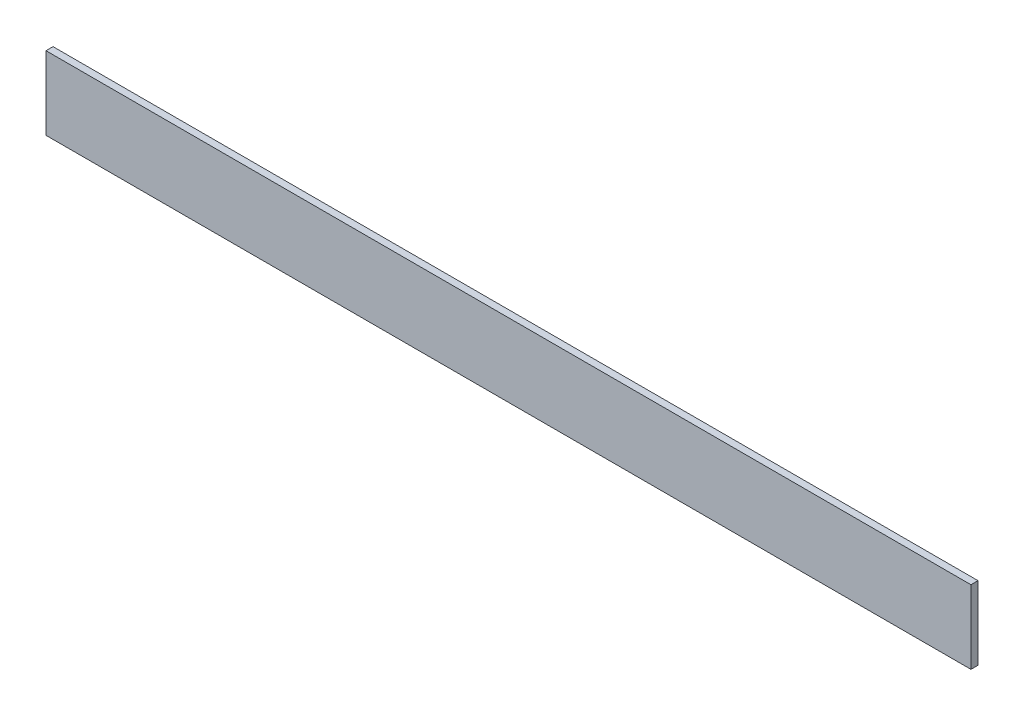
ISO-10303-21;
HEADER;
FILE_DESCRIPTION(('STEP AP214'),'2;1');
FILE_NAME('part.step','',(''),(''),'','','');
FILE_SCHEMA(('AUTOMOTIVE_DESIGN { 1 0 10303 214 1 1 1 1 }'));
ENDSEC;
DATA;
#1=APPLICATION_CONTEXT('core data for automotive mechanical design processes');
#2=APPLICATION_PROTOCOL_DEFINITION('international standard','automotive_design',2000,#1);
#3=PRODUCT_CONTEXT('',#1,'mechanical');
#4=PRODUCT('Part','Part','',(#3));
#5=PRODUCT_RELATED_PRODUCT_CATEGORY('part','',(#4));
#6=PRODUCT_DEFINITION_FORMATION('','',#4);
#7=PRODUCT_DEFINITION_CONTEXT('part definition',#1,'design');
#8=PRODUCT_DEFINITION('design','',#6,#7);
#9=PRODUCT_DEFINITION_SHAPE('','',#8);
#10=(LENGTH_UNIT() NAMED_UNIT(*) SI_UNIT(.MILLI.,.METRE.));
#11=(NAMED_UNIT(*) PLANE_ANGLE_UNIT() SI_UNIT($,.RADIAN.));
#12=(NAMED_UNIT(*) SI_UNIT($,.STERADIAN.) SOLID_ANGLE_UNIT());
#13=UNCERTAINTY_MEASURE_WITH_UNIT(LENGTH_MEASURE(1.E-05),#10,'distance_accuracy_value','');
#14=(GEOMETRIC_REPRESENTATION_CONTEXT(3) GLOBAL_UNCERTAINTY_ASSIGNED_CONTEXT((#13)) GLOBAL_UNIT_ASSIGNED_CONTEXT((#10,
#11,#12)) REPRESENTATION_CONTEXT('',''));
#15=CARTESIAN_POINT('',(0.,0.,0.));
#16=DIRECTION('',(0.,0.,1.));
#17=DIRECTION('',(1.,0.,0.));
#18=AXIS2_PLACEMENT_3D('',#15,#16,#17);
#19=CARTESIAN_POINT('',(-221.22705882353,38.7137557631378,3.175));
#20=DIRECTION('',(1.,0.,0.));
#21=DIRECTION('',(0.,0.,-1.));
#22=AXIS2_PLACEMENT_3D('',#19,#20,#21);
#23=PLANE('',#22);
#24=DIRECTION('',(0.,-1.,0.));
#25=VECTOR('',#24,1.);
#26=CARTESIAN_POINT('',(-221.22705882353,38.7137557631378,0.));
#27=LINE('',#26,#25);
#28=CARTESIAN_POINT('',(-221.22705882353,38.7137557631378,0.));
#29=VERTEX_POINT('',#28);
#30=CARTESIAN_POINT('',(-221.22705882353,5.73529411764702,0.));
#31=VERTEX_POINT('',#30);
#32=EDGE_CURVE('E102',#29,#31,#27,.T.);
#33=ORIENTED_EDGE('',*,*,#32,.T.);
#34=DIRECTION('',(0.,0.,-1.));
#35=VECTOR('',#34,1.);
#36=CARTESIAN_POINT('',(-221.22705882353,5.73529411764702,3.175));
#37=LINE('',#36,#35);
#38=CARTESIAN_POINT('',(-221.22705882353,5.73529411764702,3.175));
#39=VERTEX_POINT('',#38);
#40=EDGE_CURVE('E11',#39,#31,#37,.T.);
#41=ORIENTED_EDGE('',*,*,#40,.F.);
#42=DIRECTION('',(0.,-1.,0.));
#43=VECTOR('',#42,1.);
#44=CARTESIAN_POINT('',(-221.22705882353,38.7137557631378,3.175));
#45=LINE('',#44,#43);
#46=CARTESIAN_POINT('',(-221.22705882353,38.7137557631378,3.175));
#47=VERTEX_POINT('',#46);
#48=EDGE_CURVE('E90',#47,#39,#45,.T.);
#49=ORIENTED_EDGE('',*,*,#48,.F.);
#50=DIRECTION('',(0.,0.,-1.));
#51=VECTOR('',#50,1.);
#52=CARTESIAN_POINT('',(-221.22705882353,38.7137557631378,3.175));
#53=LINE('',#52,#51);
#54=EDGE_CURVE('E98',#47,#29,#53,.T.);
#55=ORIENTED_EDGE('',*,*,#54,.T.);
#56=EDGE_LOOP('',(#33,#41,#49,#55));
#57=FACE_BOUND('',#56,.T.);
#58=ADVANCED_FACE('F39',(#57),#23,.F.);
#59=CARTESIAN_POINT('',(-221.22705882353,5.73529411764702,3.175));
#60=DIRECTION('',(0.,1.,0.));
#61=DIRECTION('',(-1.,0.,0.));
#62=AXIS2_PLACEMENT_3D('',#59,#60,#61);
#63=PLANE('',#62);
#64=DIRECTION('',(1.,0.,0.));
#65=VECTOR('',#64,1.);
#66=CARTESIAN_POINT('',(-221.22705882353,5.73529411764702,0.));
#67=LINE('',#66,#65);
#68=CARTESIAN_POINT('',(194.85294117647,5.73529411764705,0.));
#69=VERTEX_POINT('',#68);
#70=EDGE_CURVE('E94',#31,#69,#67,.T.);
#71=ORIENTED_EDGE('',*,*,#70,.T.);
#72=DIRECTION('',(0.,0.,-1.));
#73=VECTOR('',#72,1.);
#74=CARTESIAN_POINT('',(194.85294117647,5.73529411764705,3.175));
#75=LINE('',#74,#73);
#76=CARTESIAN_POINT('',(194.85294117647,5.73529411764705,3.175));
#77=VERTEX_POINT('',#76);
#78=EDGE_CURVE('E47',#77,#69,#75,.T.);
#79=ORIENTED_EDGE('',*,*,#78,.F.);
#80=DIRECTION('',(1.,0.,0.));
#81=VECTOR('',#80,1.);
#82=CARTESIAN_POINT('',(-221.22705882353,5.73529411764702,3.175));
#83=LINE('',#82,#81);
#84=EDGE_CURVE('E85',#39,#77,#83,.T.);
#85=ORIENTED_EDGE('',*,*,#84,.F.);
#86=ORIENTED_EDGE('',*,*,#40,.T.);
#87=EDGE_LOOP('',(#71,#79,#85,#86));
#88=FACE_BOUND('',#87,.T.);
#89=ADVANCED_FACE('F93',(#88),#63,.F.);
#90=CARTESIAN_POINT('',(194.85294117647,38.7137557631378,3.175));
#91=DIRECTION('',(-1.,0.,0.));
#92=DIRECTION('',(0.,0.,1.));
#93=AXIS2_PLACEMENT_3D('',#90,#91,#92);
#94=PLANE('',#93);
#95=DIRECTION('',(0.,1.,0.));
#96=VECTOR('',#95,1.);
#97=CARTESIAN_POINT('',(194.85294117647,38.7137557631378,0.));
#98=LINE('',#97,#96);
#99=CARTESIAN_POINT('',(194.85294117647,38.7137557631378,0.));
#100=VERTEX_POINT('',#99);
#101=EDGE_CURVE('E72',#69,#100,#98,.T.);
#102=ORIENTED_EDGE('',*,*,#101,.T.);
#103=DIRECTION('',(0.,0.,-1.));
#104=VECTOR('',#103,1.);
#105=CARTESIAN_POINT('',(194.85294117647,38.7137557631378,3.175));
#106=LINE('',#105,#104);
#107=CARTESIAN_POINT('',(194.85294117647,38.7137557631378,3.175));
#108=VERTEX_POINT('',#107);
#109=EDGE_CURVE('E95',#108,#100,#106,.T.);
#110=ORIENTED_EDGE('',*,*,#109,.F.);
#111=DIRECTION('',(0.,1.,0.));
#112=VECTOR('',#111,1.);
#113=CARTESIAN_POINT('',(194.85294117647,38.7137557631378,3.175));
#114=LINE('',#113,#112);
#115=EDGE_CURVE('E88',#77,#108,#114,.T.);
#116=ORIENTED_EDGE('',*,*,#115,.F.);
#117=ORIENTED_EDGE('',*,*,#78,.T.);
#118=EDGE_LOOP('',(#102,#110,#116,#117));
#119=FACE_BOUND('',#118,.T.);
#120=ADVANCED_FACE('F96',(#119),#94,.F.);
#121=CARTESIAN_POINT('',(-221.22705882353,38.7137557631378,3.175));
#122=DIRECTION('',(0.,-1.,0.));
#123=DIRECTION('',(0.,0.,-1.));
#124=AXIS2_PLACEMENT_3D('',#121,#122,#123);
#125=PLANE('',#124);
#126=DIRECTION('',(-1.,0.,0.));
#127=VECTOR('',#126,1.);
#128=CARTESIAN_POINT('',(-221.22705882353,38.7137557631378,0.));
#129=LINE('',#128,#127);
#130=EDGE_CURVE('E78',#100,#29,#129,.T.);
#131=ORIENTED_EDGE('',*,*,#130,.T.);
#132=ORIENTED_EDGE('',*,*,#54,.F.);
#133=DIRECTION('',(-1.,0.,0.));
#134=VECTOR('',#133,1.);
#135=CARTESIAN_POINT('',(-221.22705882353,38.7137557631378,3.175));
#136=LINE('',#135,#134);
#137=EDGE_CURVE('E55',#108,#47,#136,.T.);
#138=ORIENTED_EDGE('',*,*,#137,.F.);
#139=ORIENTED_EDGE('',*,*,#109,.T.);
#140=EDGE_LOOP('',(#131,#132,#138,#139));
#141=FACE_BOUND('',#140,.T.);
#142=ADVANCED_FACE('F109',(#141),#125,.F.);
#143=CARTESIAN_POINT('',(0.,0.,3.175));
#144=DIRECTION('',(0.,0.,1.));
#145=DIRECTION('',(1.,0.,0.));
#146=AXIS2_PLACEMENT_3D('',#143,#144,#145);
#147=PLANE('',#146);
#148=ORIENTED_EDGE('',*,*,#48,.T.);
#149=ORIENTED_EDGE('',*,*,#84,.T.);
#150=ORIENTED_EDGE('',*,*,#115,.T.);
#151=ORIENTED_EDGE('',*,*,#137,.T.);
#152=EDGE_LOOP('',(#148,#149,#150,#151));
#153=FACE_BOUND('',#152,.T.);
#154=ADVANCED_FACE('F86',(#153),#147,.T.);
#155=CARTESIAN_POINT('',(0.,0.,0.));
#156=DIRECTION('',(0.,0.,1.));
#157=DIRECTION('',(1.,0.,0.));
#158=AXIS2_PLACEMENT_3D('',#155,#156,#157);
#159=PLANE('',#158);
#160=ORIENTED_EDGE('',*,*,#32,.F.);
#161=ORIENTED_EDGE('',*,*,#130,.F.);
#162=ORIENTED_EDGE('',*,*,#101,.F.);
#163=ORIENTED_EDGE('',*,*,#70,.F.);
#164=EDGE_LOOP('',(#160,#161,#162,#163));
#165=FACE_BOUND('',#164,.T.);
#166=ADVANCED_FACE('F112',(#165),#159,.F.);
#167=CLOSED_SHELL('',(#58,#89,#120,#142,#154,#166));
#168=MANIFOLD_SOLID_BREP('B2',#167);
#169=ADVANCED_BREP_SHAPE_REPRESENTATION('',(#18,#168),#14);
#170=SHAPE_DEFINITION_REPRESENTATION(#9,#169);
ENDSEC;
END-ISO-10303-21;
